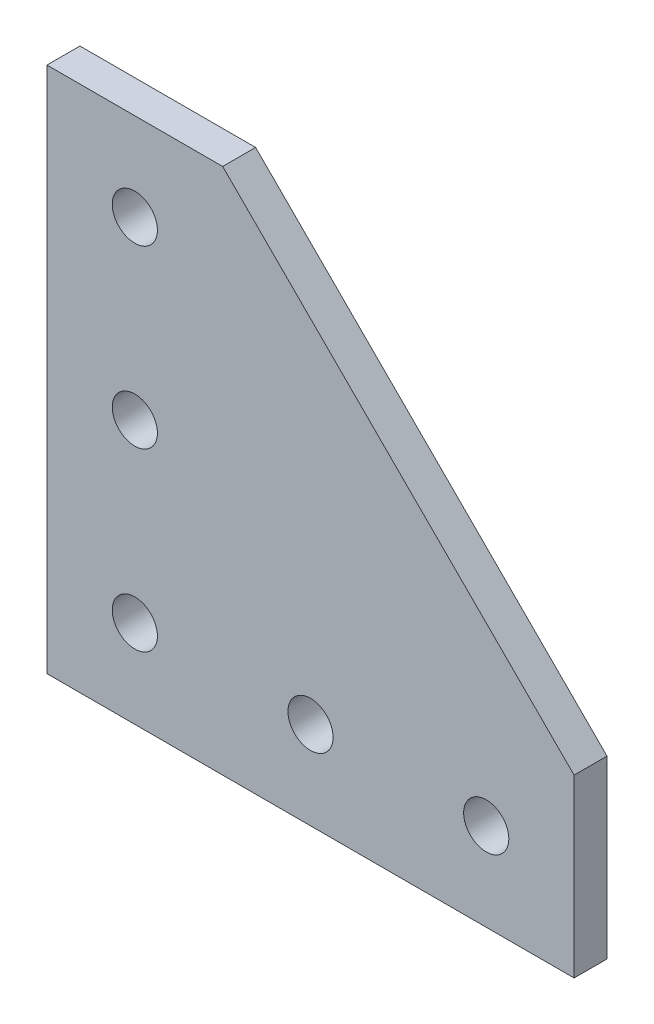
ISO-10303-21;
HEADER;
FILE_DESCRIPTION(('STEP AP214'),'2;1');
FILE_NAME('part.step','',(''),(''),'','','');
FILE_SCHEMA(('AUTOMOTIVE_DESIGN { 1 0 10303 214 1 1 1 1 }'));
ENDSEC;
DATA;
#1=APPLICATION_CONTEXT('core data for automotive mechanical design processes');
#2=APPLICATION_PROTOCOL_DEFINITION('international standard','automotive_design',2000,#1);
#3=PRODUCT_CONTEXT('',#1,'mechanical');
#4=PRODUCT('Part','Part','',(#3));
#5=PRODUCT_RELATED_PRODUCT_CATEGORY('part','',(#4));
#6=PRODUCT_DEFINITION_FORMATION('','',#4);
#7=PRODUCT_DEFINITION_CONTEXT('part definition',#1,'design');
#8=PRODUCT_DEFINITION('design','',#6,#7);
#9=PRODUCT_DEFINITION_SHAPE('','',#8);
#10=(LENGTH_UNIT() NAMED_UNIT(*) SI_UNIT(.MILLI.,.METRE.));
#11=(NAMED_UNIT(*) PLANE_ANGLE_UNIT() SI_UNIT($,.RADIAN.));
#12=(NAMED_UNIT(*) SI_UNIT($,.STERADIAN.) SOLID_ANGLE_UNIT());
#13=UNCERTAINTY_MEASURE_WITH_UNIT(LENGTH_MEASURE(1.E-05),#10,'distance_accuracy_value','');
#14=(GEOMETRIC_REPRESENTATION_CONTEXT(3) GLOBAL_UNCERTAINTY_ASSIGNED_CONTEXT((#13)) GLOBAL_UNIT_ASSIGNED_CONTEXT((#10,
#11,#12)) REPRESENTATION_CONTEXT('',''));
#15=CARTESIAN_POINT('',(0.,0.,0.));
#16=DIRECTION('',(0.,0.,1.));
#17=DIRECTION('',(1.,0.,0.));
#18=AXIS2_PLACEMENT_3D('',#15,#16,#17);
#19=CARTESIAN_POINT('',(0.,0.,2.38125));
#20=DIRECTION('',(0.,0.,-1.));
#21=DIRECTION('',(-1.,0.,0.));
#22=AXIS2_PLACEMENT_3D('',#19,#20,#21);
#23=PLANE('',#22);
#24=CARTESIAN_POINT('',(12.7,63.5,2.38125));
#25=DIRECTION('',(0.,0.,1.));
#26=DIRECTION('',(1.,0.,0.));
#27=AXIS2_PLACEMENT_3D('',#24,#25,#26);
#28=CIRCLE('',#27,3.2639);
#29=CARTESIAN_POINT('',(15.9639,63.5,2.38125));
#30=VERTEX_POINT('',#29);
#31=EDGE_CURVE('E178',#30,#30,#28,.T.);
#32=ORIENTED_EDGE('',*,*,#31,.F.);
#33=EDGE_LOOP('',(#32));
#34=FACE_BOUND('',#33,.T.);
#35=CARTESIAN_POINT('',(38.1,12.7,2.38125));
#36=DIRECTION('',(0.,0.,1.));
#37=DIRECTION('',(1.,0.,0.));
#38=AXIS2_PLACEMENT_3D('',#35,#36,#37);
#39=CIRCLE('',#38,3.26389999999999);
#40=CARTESIAN_POINT('',(41.3639,12.7,2.38125));
#41=VERTEX_POINT('',#40);
#42=EDGE_CURVE('E190',#41,#41,#39,.T.);
#43=ORIENTED_EDGE('',*,*,#42,.F.);
#44=EDGE_LOOP('',(#43));
#45=FACE_BOUND('',#44,.T.);
#46=DIRECTION('',(1.,0.,0.));
#47=VECTOR('',#46,1.);
#48=CARTESIAN_POINT('',(76.2,0.,2.38125));
#49=LINE('',#48,#47);
#50=CARTESIAN_POINT('',(0.,0.,2.38125));
#51=VERTEX_POINT('',#50);
#52=CARTESIAN_POINT('',(76.2,0.,2.38125));
#53=VERTEX_POINT('',#52);
#54=EDGE_CURVE('E118',#51,#53,#49,.T.);
#55=ORIENTED_EDGE('',*,*,#54,.T.);
#56=DIRECTION('',(0.,1.,0.));
#57=VECTOR('',#56,1.);
#58=CARTESIAN_POINT('',(76.2,25.4,2.38125));
#59=LINE('',#58,#57);
#60=CARTESIAN_POINT('',(76.2,25.4,2.38125));
#61=VERTEX_POINT('',#60);
#62=EDGE_CURVE('E85',#53,#61,#59,.T.);
#63=ORIENTED_EDGE('',*,*,#62,.T.);
#64=DIRECTION('',(-0.707106781186547,0.707106781186547,0.));
#65=VECTOR('',#64,1.);
#66=CARTESIAN_POINT('',(76.2,25.4,2.38125));
#67=LINE('',#66,#65);
#68=CARTESIAN_POINT('',(25.4,76.2,2.38125));
#69=VERTEX_POINT('',#68);
#70=EDGE_CURVE('E89',#61,#69,#67,.T.);
#71=ORIENTED_EDGE('',*,*,#70,.T.);
#72=DIRECTION('',(-1.,0.,0.));
#73=VECTOR('',#72,1.);
#74=CARTESIAN_POINT('',(0.,76.2,2.38125));
#75=LINE('',#74,#73);
#76=CARTESIAN_POINT('',(0.,76.2,2.38125));
#77=VERTEX_POINT('',#76);
#78=EDGE_CURVE('E93',#69,#77,#75,.T.);
#79=ORIENTED_EDGE('',*,*,#78,.T.);
#80=DIRECTION('',(0.,-1.,0.));
#81=VECTOR('',#80,1.);
#82=CARTESIAN_POINT('',(0.,0.,2.38125));
#83=LINE('',#82,#81);
#84=EDGE_CURVE('E51',#77,#51,#83,.T.);
#85=ORIENTED_EDGE('',*,*,#84,.T.);
#86=EDGE_LOOP('',(#55,#63,#71,#79,#85));
#87=FACE_BOUND('',#86,.T.);
#88=CARTESIAN_POINT('',(12.7,12.7,2.38125));
#89=DIRECTION('',(0.,0.,1.));
#90=DIRECTION('',(1.,0.,0.));
#91=AXIS2_PLACEMENT_3D('',#88,#89,#90);
#92=CIRCLE('',#91,3.2639);
#93=CARTESIAN_POINT('',(15.9639,12.7,2.38125));
#94=VERTEX_POINT('',#93);
#95=EDGE_CURVE('E113',#94,#94,#92,.T.);
#96=ORIENTED_EDGE('',*,*,#95,.F.);
#97=EDGE_LOOP('',(#96));
#98=FACE_BOUND('',#97,.T.);
#99=CARTESIAN_POINT('',(63.5,12.7,2.38125));
#100=DIRECTION('',(0.,0.,1.));
#101=DIRECTION('',(1.,0.,0.));
#102=AXIS2_PLACEMENT_3D('',#99,#100,#101);
#103=CIRCLE('',#102,3.26389999999999);
#104=CARTESIAN_POINT('',(66.7639,12.7,2.38125));
#105=VERTEX_POINT('',#104);
#106=EDGE_CURVE('E184',#105,#105,#103,.T.);
#107=ORIENTED_EDGE('',*,*,#106,.F.);
#108=EDGE_LOOP('',(#107));
#109=FACE_BOUND('',#108,.T.);
#110=CARTESIAN_POINT('',(12.7,38.1,2.38125));
#111=DIRECTION('',(0.,0.,1.));
#112=DIRECTION('',(1.,0.,0.));
#113=AXIS2_PLACEMENT_3D('',#110,#111,#112);
#114=CIRCLE('',#113,3.26389999999999);
#115=CARTESIAN_POINT('',(15.9639,38.1,2.38125));
#116=VERTEX_POINT('',#115);
#117=EDGE_CURVE('E169',#116,#116,#114,.T.);
#118=ORIENTED_EDGE('',*,*,#117,.F.);
#119=EDGE_LOOP('',(#118));
#120=FACE_BOUND('',#119,.T.);
#121=ADVANCED_FACE('F34',(#34,#45,#87,#98,#109,#120),#23,.F.);
#122=CARTESIAN_POINT('',(0.,0.,-2.38125));
#123=DIRECTION('',(0.,0.,-1.));
#124=DIRECTION('',(-1.,0.,0.));
#125=AXIS2_PLACEMENT_3D('',#122,#123,#124);
#126=PLANE('',#125);
#127=CARTESIAN_POINT('',(12.7,63.5,-2.38125));
#128=DIRECTION('',(0.,0.,1.));
#129=DIRECTION('',(1.,0.,0.));
#130=AXIS2_PLACEMENT_3D('',#127,#128,#129);
#131=CIRCLE('',#130,3.2639);
#132=CARTESIAN_POINT('',(15.9639,63.5,-2.38125));
#133=VERTEX_POINT('',#132);
#134=EDGE_CURVE('E175',#133,#133,#131,.T.);
#135=ORIENTED_EDGE('',*,*,#134,.T.);
#136=EDGE_LOOP('',(#135));
#137=FACE_BOUND('',#136,.T.);
#138=CARTESIAN_POINT('',(38.1,12.7,-2.38125));
#139=DIRECTION('',(0.,0.,1.));
#140=DIRECTION('',(1.,0.,0.));
#141=AXIS2_PLACEMENT_3D('',#138,#139,#140);
#142=CIRCLE('',#141,3.26389999999999);
#143=CARTESIAN_POINT('',(41.3639,12.7,-2.38125));
#144=VERTEX_POINT('',#143);
#145=EDGE_CURVE('E187',#144,#144,#142,.T.);
#146=ORIENTED_EDGE('',*,*,#145,.T.);
#147=EDGE_LOOP('',(#146));
#148=FACE_BOUND('',#147,.T.);
#149=DIRECTION('',(1.,0.,0.));
#150=VECTOR('',#149,1.);
#151=CARTESIAN_POINT('',(76.2,0.,-2.38125));
#152=LINE('',#151,#150);
#153=CARTESIAN_POINT('',(0.,0.,-2.38125));
#154=VERTEX_POINT('',#153);
#155=CARTESIAN_POINT('',(76.2,0.,-2.38125));
#156=VERTEX_POINT('',#155);
#157=EDGE_CURVE('E109',#154,#156,#152,.T.);
#158=ORIENTED_EDGE('',*,*,#157,.F.);
#159=DIRECTION('',(0.,-1.,0.));
#160=VECTOR('',#159,1.);
#161=CARTESIAN_POINT('',(0.,0.,-2.38125));
#162=LINE('',#161,#160);
#163=CARTESIAN_POINT('',(0.,76.2,-2.38125));
#164=VERTEX_POINT('',#163);
#165=EDGE_CURVE('E77',#164,#154,#162,.T.);
#166=ORIENTED_EDGE('',*,*,#165,.F.);
#167=DIRECTION('',(-1.,0.,0.));
#168=VECTOR('',#167,1.);
#169=CARTESIAN_POINT('',(0.,76.2,-2.38125));
#170=LINE('',#169,#168);
#171=CARTESIAN_POINT('',(25.4,76.2,-2.38125));
#172=VERTEX_POINT('',#171);
#173=EDGE_CURVE('E71',#172,#164,#170,.T.);
#174=ORIENTED_EDGE('',*,*,#173,.F.);
#175=DIRECTION('',(-0.707106781186547,0.707106781186547,0.));
#176=VECTOR('',#175,1.);
#177=CARTESIAN_POINT('',(76.2,25.4,-2.38125));
#178=LINE('',#177,#176);
#179=CARTESIAN_POINT('',(76.2,25.4,-2.38125));
#180=VERTEX_POINT('',#179);
#181=EDGE_CURVE('E100',#180,#172,#178,.T.);
#182=ORIENTED_EDGE('',*,*,#181,.F.);
#183=DIRECTION('',(0.,1.,0.));
#184=VECTOR('',#183,1.);
#185=CARTESIAN_POINT('',(76.2,25.4,-2.38125));
#186=LINE('',#185,#184);
#187=EDGE_CURVE('E112',#156,#180,#186,.T.);
#188=ORIENTED_EDGE('',*,*,#187,.F.);
#189=EDGE_LOOP('',(#158,#166,#174,#182,#188));
#190=FACE_BOUND('',#189,.T.);
#191=CARTESIAN_POINT('',(12.7,12.7,-2.38125));
#192=DIRECTION('',(0.,0.,1.));
#193=DIRECTION('',(1.,0.,0.));
#194=AXIS2_PLACEMENT_3D('',#191,#192,#193);
#195=CIRCLE('',#194,3.2639);
#196=CARTESIAN_POINT('',(15.9639,12.7,-2.38125));
#197=VERTEX_POINT('',#196);
#198=EDGE_CURVE('E193',#197,#197,#195,.T.);
#199=ORIENTED_EDGE('',*,*,#198,.T.);
#200=EDGE_LOOP('',(#199));
#201=FACE_BOUND('',#200,.T.);
#202=CARTESIAN_POINT('',(63.5,12.7,-2.38125));
#203=DIRECTION('',(0.,0.,1.));
#204=DIRECTION('',(1.,0.,0.));
#205=AXIS2_PLACEMENT_3D('',#202,#203,#204);
#206=CIRCLE('',#205,3.26389999999999);
#207=CARTESIAN_POINT('',(66.7639,12.7,-2.38125));
#208=VERTEX_POINT('',#207);
#209=EDGE_CURVE('E181',#208,#208,#206,.T.);
#210=ORIENTED_EDGE('',*,*,#209,.T.);
#211=EDGE_LOOP('',(#210));
#212=FACE_BOUND('',#211,.T.);
#213=CARTESIAN_POINT('',(12.7,38.1,-2.38125));
#214=DIRECTION('',(0.,0.,1.));
#215=DIRECTION('',(1.,0.,0.));
#216=AXIS2_PLACEMENT_3D('',#213,#214,#215);
#217=CIRCLE('',#216,3.26389999999999);
#218=CARTESIAN_POINT('',(15.9639,38.1,-2.38125));
#219=VERTEX_POINT('',#218);
#220=EDGE_CURVE('E172',#219,#219,#217,.T.);
#221=ORIENTED_EDGE('',*,*,#220,.T.);
#222=EDGE_LOOP('',(#221));
#223=FACE_BOUND('',#222,.T.);
#224=ADVANCED_FACE('F122',(#137,#148,#190,#201,#212,#223),#126,.T.);
#225=CARTESIAN_POINT('',(76.2,0.,2.38125));
#226=DIRECTION('',(0.,1.,0.));
#227=DIRECTION('',(-1.,0.,0.));
#228=AXIS2_PLACEMENT_3D('',#225,#226,#227);
#229=PLANE('',#228);
#230=ORIENTED_EDGE('',*,*,#157,.T.);
#231=DIRECTION('',(0.,0.,-1.));
#232=VECTOR('',#231,1.);
#233=CARTESIAN_POINT('',(76.2,0.,2.38125));
#234=LINE('',#233,#232);
#235=EDGE_CURVE('E11',#53,#156,#234,.T.);
#236=ORIENTED_EDGE('',*,*,#235,.F.);
#237=ORIENTED_EDGE('',*,*,#54,.F.);
#238=DIRECTION('',(0.,0.,-1.));
#239=VECTOR('',#238,1.);
#240=CARTESIAN_POINT('',(0.,0.,2.38125));
#241=LINE('',#240,#239);
#242=EDGE_CURVE('E105',#51,#154,#241,.T.);
#243=ORIENTED_EDGE('',*,*,#242,.T.);
#244=EDGE_LOOP('',(#230,#236,#237,#243));
#245=FACE_BOUND('',#244,.T.);
#246=ADVANCED_FACE('F36',(#245),#229,.F.);
#247=CARTESIAN_POINT('',(76.2,25.4,2.38125));
#248=DIRECTION('',(-1.,0.,0.));
#249=DIRECTION('',(0.,0.,1.));
#250=AXIS2_PLACEMENT_3D('',#247,#248,#249);
#251=PLANE('',#250);
#252=ORIENTED_EDGE('',*,*,#187,.T.);
#253=DIRECTION('',(0.,0.,-1.));
#254=VECTOR('',#253,1.);
#255=CARTESIAN_POINT('',(76.2,25.4,2.38125));
#256=LINE('',#255,#254);
#257=EDGE_CURVE('E43',#61,#180,#256,.T.);
#258=ORIENTED_EDGE('',*,*,#257,.F.);
#259=ORIENTED_EDGE('',*,*,#62,.F.);
#260=ORIENTED_EDGE('',*,*,#235,.T.);
#261=EDGE_LOOP('',(#252,#258,#259,#260));
#262=FACE_BOUND('',#261,.T.);
#263=ADVANCED_FACE('F250',(#262),#251,.F.);
#264=CARTESIAN_POINT('',(76.2,25.4,2.38125));
#265=DIRECTION('',(-0.707106781186547,-0.707106781186547,0.));
#266=DIRECTION('',(0.707106781186548,-0.707106781186548,0.));
#267=AXIS2_PLACEMENT_3D('',#264,#265,#266);
#268=PLANE('',#267);
#269=ORIENTED_EDGE('',*,*,#181,.T.);
#270=DIRECTION('',(0.,0.,-1.));
#271=VECTOR('',#270,1.);
#272=CARTESIAN_POINT('',(25.4,76.2,2.38125));
#273=LINE('',#272,#271);
#274=EDGE_CURVE('E97',#69,#172,#273,.T.);
#275=ORIENTED_EDGE('',*,*,#274,.F.);
#276=ORIENTED_EDGE('',*,*,#70,.F.);
#277=ORIENTED_EDGE('',*,*,#257,.T.);
#278=EDGE_LOOP('',(#269,#275,#276,#277));
#279=FACE_BOUND('',#278,.T.);
#280=ADVANCED_FACE('F98',(#279),#268,.F.);
#281=CARTESIAN_POINT('',(0.,76.2,2.38125));
#282=DIRECTION('',(0.,-1.,0.));
#283=DIRECTION('',(0.,0.,-1.));
#284=AXIS2_PLACEMENT_3D('',#281,#282,#283);
#285=PLANE('',#284);
#286=ORIENTED_EDGE('',*,*,#173,.T.);
#287=DIRECTION('',(0.,0.,-1.));
#288=VECTOR('',#287,1.);
#289=CARTESIAN_POINT('',(0.,76.2,2.38125));
#290=LINE('',#289,#288);
#291=EDGE_CURVE('E101',#77,#164,#290,.T.);
#292=ORIENTED_EDGE('',*,*,#291,.F.);
#293=ORIENTED_EDGE('',*,*,#78,.F.);
#294=ORIENTED_EDGE('',*,*,#274,.T.);
#295=EDGE_LOOP('',(#286,#292,#293,#294));
#296=FACE_BOUND('',#295,.T.);
#297=ADVANCED_FACE('F103',(#296),#285,.F.);
#298=CARTESIAN_POINT('',(0.,0.,2.38125));
#299=DIRECTION('',(1.,0.,0.));
#300=DIRECTION('',(0.,0.,-1.));
#301=AXIS2_PLACEMENT_3D('',#298,#299,#300);
#302=PLANE('',#301);
#303=ORIENTED_EDGE('',*,*,#165,.T.);
#304=ORIENTED_EDGE('',*,*,#242,.F.);
#305=ORIENTED_EDGE('',*,*,#84,.F.);
#306=ORIENTED_EDGE('',*,*,#291,.T.);
#307=EDGE_LOOP('',(#303,#304,#305,#306));
#308=FACE_BOUND('',#307,.T.);
#309=ADVANCED_FACE('F127',(#308),#302,.F.);
#310=CARTESIAN_POINT('',(12.7,12.7,2.38125));
#311=DIRECTION('',(0.,0.,-1.));
#312=DIRECTION('',(-1.,0.,0.));
#313=AXIS2_PLACEMENT_3D('',#310,#311,#312);
#314=CYLINDRICAL_SURFACE('',#313,3.2639);
#315=ORIENTED_EDGE('',*,*,#95,.T.);
#316=EDGE_LOOP('',(#315));
#317=FACE_BOUND('',#316,.T.);
#318=ORIENTED_EDGE('',*,*,#198,.F.);
#319=EDGE_LOOP('',(#318));
#320=FACE_BOUND('',#319,.T.);
#321=ADVANCED_FACE('F129',(#317,#320),#314,.F.);
#322=CARTESIAN_POINT('',(38.1,12.7,2.38125));
#323=DIRECTION('',(0.,0.,-1.));
#324=DIRECTION('',(-1.,0.,0.));
#325=AXIS2_PLACEMENT_3D('',#322,#323,#324);
#326=CYLINDRICAL_SURFACE('',#325,3.26389999999999);
#327=ORIENTED_EDGE('',*,*,#42,.T.);
#328=EDGE_LOOP('',(#327));
#329=FACE_BOUND('',#328,.T.);
#330=ORIENTED_EDGE('',*,*,#145,.F.);
#331=EDGE_LOOP('',(#330));
#332=FACE_BOUND('',#331,.T.);
#333=ADVANCED_FACE('F135',(#329,#332),#326,.F.);
#334=CARTESIAN_POINT('',(63.5,12.7,2.38125));
#335=DIRECTION('',(0.,0.,-1.));
#336=DIRECTION('',(-1.,0.,0.));
#337=AXIS2_PLACEMENT_3D('',#334,#335,#336);
#338=CYLINDRICAL_SURFACE('',#337,3.26389999999999);
#339=ORIENTED_EDGE('',*,*,#106,.T.);
#340=EDGE_LOOP('',(#339));
#341=FACE_BOUND('',#340,.T.);
#342=ORIENTED_EDGE('',*,*,#209,.F.);
#343=EDGE_LOOP('',(#342));
#344=FACE_BOUND('',#343,.T.);
#345=ADVANCED_FACE('F152',(#341,#344),#338,.F.);
#346=CARTESIAN_POINT('',(12.7,63.5,2.38125));
#347=DIRECTION('',(0.,0.,-1.));
#348=DIRECTION('',(-1.,0.,0.));
#349=AXIS2_PLACEMENT_3D('',#346,#347,#348);
#350=CYLINDRICAL_SURFACE('',#349,3.2639);
#351=ORIENTED_EDGE('',*,*,#31,.T.);
#352=EDGE_LOOP('',(#351));
#353=FACE_BOUND('',#352,.T.);
#354=ORIENTED_EDGE('',*,*,#134,.F.);
#355=EDGE_LOOP('',(#354));
#356=FACE_BOUND('',#355,.T.);
#357=ADVANCED_FACE('F156',(#353,#356),#350,.F.);
#358=CARTESIAN_POINT('',(12.7,38.1,2.38125));
#359=DIRECTION('',(0.,0.,-1.));
#360=DIRECTION('',(-1.,0.,0.));
#361=AXIS2_PLACEMENT_3D('',#358,#359,#360);
#362=CYLINDRICAL_SURFACE('',#361,3.26389999999999);
#363=ORIENTED_EDGE('',*,*,#117,.T.);
#364=EDGE_LOOP('',(#363));
#365=FACE_BOUND('',#364,.T.);
#366=ORIENTED_EDGE('',*,*,#220,.F.);
#367=EDGE_LOOP('',(#366));
#368=FACE_BOUND('',#367,.T.);
#369=ADVANCED_FACE('F160',(#365,#368),#362,.F.);
#370=CLOSED_SHELL('',(#121,#224,#246,#263,#280,#297,#309,#321,#333,#345,#357,#369));
#371=MANIFOLD_SOLID_BREP('B2',#370);
#372=ADVANCED_BREP_SHAPE_REPRESENTATION('',(#18,#371),#14);
#373=SHAPE_DEFINITION_REPRESENTATION(#9,#372);
ENDSEC;
END-ISO-10303-21;
